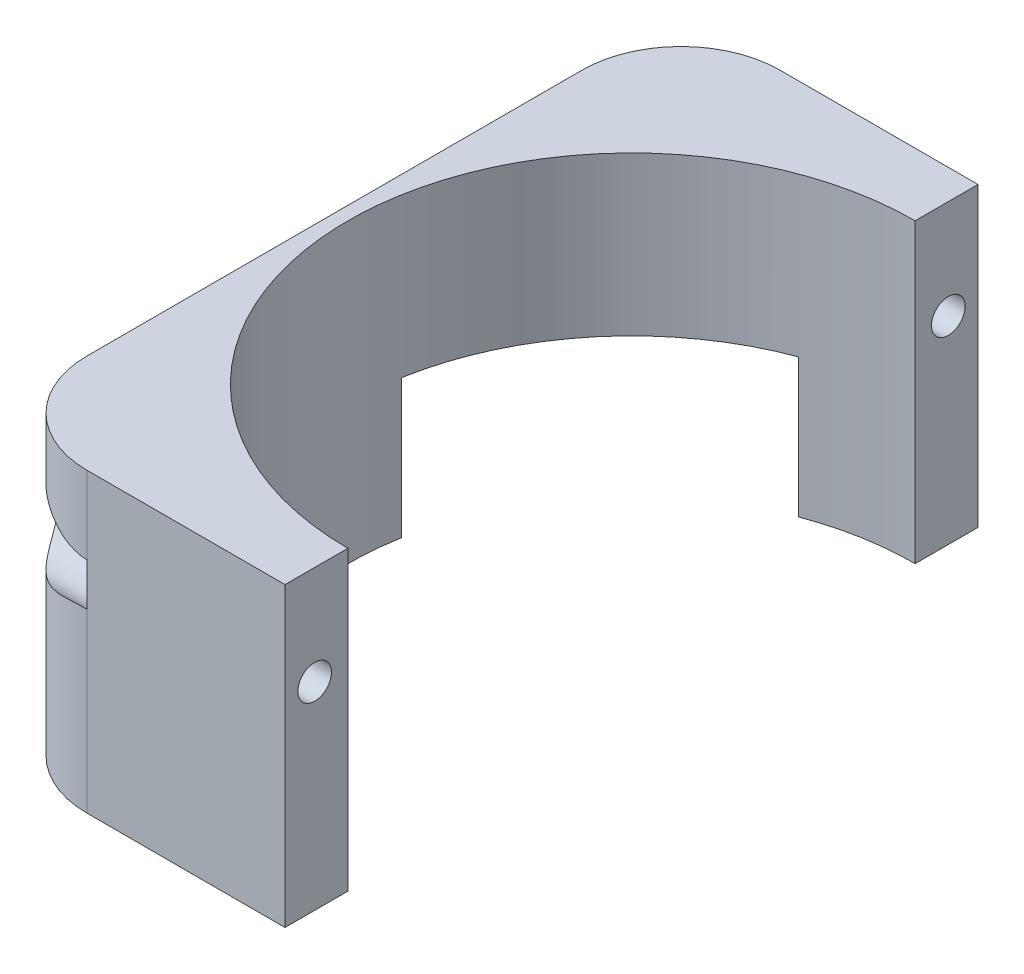
ISO-10303-21;
HEADER;
FILE_DESCRIPTION(('STEP AP214'),'2;1');
FILE_NAME('part.step','',(''),(''),'','','');
FILE_SCHEMA(('AUTOMOTIVE_DESIGN { 1 0 10303 214 1 1 1 1 }'));
ENDSEC;
DATA;
#1=APPLICATION_CONTEXT('core data for automotive mechanical design processes');
#2=APPLICATION_PROTOCOL_DEFINITION('international standard','automotive_design',2000,#1);
#3=PRODUCT_CONTEXT('',#1,'mechanical');
#4=PRODUCT('Part','Part','',(#3));
#5=PRODUCT_RELATED_PRODUCT_CATEGORY('part','',(#4));
#6=PRODUCT_DEFINITION_FORMATION('','',#4);
#7=PRODUCT_DEFINITION_CONTEXT('part definition',#1,'design');
#8=PRODUCT_DEFINITION('design','',#6,#7);
#9=PRODUCT_DEFINITION_SHAPE('','',#8);
#10=(LENGTH_UNIT() NAMED_UNIT(*) SI_UNIT(.MILLI.,.METRE.));
#11=(NAMED_UNIT(*) PLANE_ANGLE_UNIT() SI_UNIT($,.RADIAN.));
#12=(NAMED_UNIT(*) SI_UNIT($,.STERADIAN.) SOLID_ANGLE_UNIT());
#13=UNCERTAINTY_MEASURE_WITH_UNIT(LENGTH_MEASURE(1.E-05),#10,'distance_accuracy_value','');
#14=(GEOMETRIC_REPRESENTATION_CONTEXT(3) GLOBAL_UNCERTAINTY_ASSIGNED_CONTEXT((#13)) GLOBAL_UNIT_ASSIGNED_CONTEXT((#10,
#11,#12)) REPRESENTATION_CONTEXT('',''));
#15=CARTESIAN_POINT('',(0.,0.,0.));
#16=DIRECTION('',(0.,0.,1.));
#17=DIRECTION('',(1.,0.,0.));
#18=AXIS2_PLACEMENT_3D('',#15,#16,#17);
#19=CARTESIAN_POINT('',(-40.,20.,32.));
#20=DIRECTION('',(1.,0.,0.));
#21=DIRECTION('',(0.,0.,-1.));
#22=AXIS2_PLACEMENT_3D('',#19,#20,#21);
#23=CYLINDRICAL_SURFACE('',#22,1.7);
#24=CARTESIAN_POINT('',(0.,20.,32.));
#25=DIRECTION('',(1.,0.,0.));
#26=DIRECTION('',(0.,0.,-1.));
#27=AXIS2_PLACEMENT_3D('',#24,#25,#26);
#28=CIRCLE('',#27,1.7);
#29=CARTESIAN_POINT('',(0.,20.,30.3));
#30=VERTEX_POINT('',#29);
#31=EDGE_CURVE('E214',#30,#30,#28,.T.);
#32=ORIENTED_EDGE('',*,*,#31,.T.);
#33=EDGE_LOOP('',(#32));
#34=FACE_BOUND('',#33,.T.);
#35=CARTESIAN_POINT('',(-20.,20.,32.));
#36=DIRECTION('',(-1.,0.,0.));
#37=DIRECTION('',(0.,0.,1.));
#38=AXIS2_PLACEMENT_3D('',#35,#36,#37);
#39=CIRCLE('',#38,1.7);
#40=CARTESIAN_POINT('',(-20.,20.,33.7));
#41=VERTEX_POINT('',#40);
#42=EDGE_CURVE('E174',#41,#41,#39,.F.);
#43=ORIENTED_EDGE('',*,*,#42,.F.);
#44=EDGE_LOOP('',(#43));
#45=FACE_BOUND('',#44,.T.);
#46=ADVANCED_FACE('F38',(#34,#45),#23,.F.);
#47=CARTESIAN_POINT('',(-40.,20.,-32.));
#48=DIRECTION('',(1.,0.,0.));
#49=DIRECTION('',(0.,0.,-1.));
#50=AXIS2_PLACEMENT_3D('',#47,#48,#49);
#51=CYLINDRICAL_SURFACE('',#50,1.7);
#52=CARTESIAN_POINT('',(0.,20.,-32.));
#53=DIRECTION('',(1.,0.,0.));
#54=DIRECTION('',(0.,0.,-1.));
#55=AXIS2_PLACEMENT_3D('',#52,#53,#54);
#56=CIRCLE('',#55,1.7);
#57=CARTESIAN_POINT('',(0.,20.,-33.7));
#58=VERTEX_POINT('',#57);
#59=EDGE_CURVE('E224',#58,#58,#56,.T.);
#60=ORIENTED_EDGE('',*,*,#59,.T.);
#61=EDGE_LOOP('',(#60));
#62=FACE_BOUND('',#61,.T.);
#63=CARTESIAN_POINT('',(-20.,20.,-32.));
#64=DIRECTION('',(-1.,0.,0.));
#65=DIRECTION('',(0.,0.,1.));
#66=AXIS2_PLACEMENT_3D('',#63,#64,#65);
#67=CIRCLE('',#66,1.7);
#68=CARTESIAN_POINT('',(-20.,20.,-30.3));
#69=VERTEX_POINT('',#68);
#70=EDGE_CURVE('E188',#69,#69,#67,.F.);
#71=ORIENTED_EDGE('',*,*,#70,.F.);
#72=EDGE_LOOP('',(#71));
#73=FACE_BOUND('',#72,.T.);
#74=ADVANCED_FACE('F328',(#62,#73),#51,.F.);
#75=CARTESIAN_POINT('',(0.,0.,0.));
#76=DIRECTION('',(0.,1.,0.));
#77=DIRECTION('',(0.,0.,1.));
#78=AXIS2_PLACEMENT_3D('',#75,#76,#77);
#79=PLANE('',#78);
#80=DIRECTION('',(1.,0.,0.));
#81=VECTOR('',#80,1.);
#82=CARTESIAN_POINT('',(-30.,0.,35.));
#83=LINE('',#82,#81);
#84=CARTESIAN_POINT('',(-20.,0.,35.));
#85=VERTEX_POINT('',#84);
#86=CARTESIAN_POINT('',(0.,0.,35.));
#87=VERTEX_POINT('',#86);
#88=EDGE_CURVE('E259',#85,#87,#83,.T.);
#89=ORIENTED_EDGE('',*,*,#88,.F.);
#90=CARTESIAN_POINT('',(-20.,0.,25.));
#91=DIRECTION('',(0.,1.,0.));
#92=DIRECTION('',(0.,0.,1.));
#93=AXIS2_PLACEMENT_3D('',#90,#91,#92);
#94=CIRCLE('',#93,10.);
#95=CARTESIAN_POINT('',(-30.,0.,25.));
#96=VERTEX_POINT('',#95);
#97=EDGE_CURVE('E157',#85,#96,#94,.F.);
#98=ORIENTED_EDGE('',*,*,#97,.T.);
#99=DIRECTION('',(0.,0.,1.));
#100=VECTOR('',#99,1.);
#101=CARTESIAN_POINT('',(-30.,0.,-35.));
#102=LINE('',#101,#100);
#103=CARTESIAN_POINT('',(-30.,0.,-5.00000000000002));
#104=VERTEX_POINT('',#103);
#105=EDGE_CURVE('E269',#104,#96,#102,.T.);
#106=ORIENTED_EDGE('',*,*,#105,.F.);
#107=DIRECTION('',(-1.,0.,0.));
#108=VECTOR('',#107,1.);
#109=CARTESIAN_POINT('',(-30.,0.,-5.00000000000002));
#110=LINE('',#109,#108);
#111=CARTESIAN_POINT('',(-28.2103261236023,0.,-5.00000000000002));
#112=VERTEX_POINT('',#111);
#113=EDGE_CURVE('E202',#112,#104,#110,.T.);
#114=ORIENTED_EDGE('',*,*,#113,.F.);
#115=CARTESIAN_POINT('',(0.,0.,0.));
#116=DIRECTION('',(0.,1.,0.));
#117=DIRECTION('',(0.,0.,1.));
#118=AXIS2_PLACEMENT_3D('',#115,#116,#117);
#119=CIRCLE('',#118,28.65);
#120=CARTESIAN_POINT('',(0.,0.,28.65));
#121=VERTEX_POINT('',#120);
#122=EDGE_CURVE('E245',#112,#121,#119,.T.);
#123=ORIENTED_EDGE('',*,*,#122,.T.);
#124=DIRECTION('',(0.,0.,1.));
#125=VECTOR('',#124,1.);
#126=CARTESIAN_POINT('',(0.,0.,-46.2261777715974));
#127=LINE('',#126,#125);
#128=EDGE_CURVE('E229',#121,#87,#127,.T.);
#129=ORIENTED_EDGE('',*,*,#128,.T.);
#130=EDGE_LOOP('',(#89,#98,#106,#114,#123,#129));
#131=FACE_BOUND('',#130,.T.);
#132=ADVANCED_FACE('F332',(#131),#79,.F.);
#133=CARTESIAN_POINT('',(0.,30.,0.));
#134=DIRECTION('',(0.,1.,0.));
#135=DIRECTION('',(0.,0.,1.));
#136=AXIS2_PLACEMENT_3D('',#133,#134,#135);
#137=PLANE('',#136);
#138=DIRECTION('',(0.,0.,1.));
#139=VECTOR('',#138,1.);
#140=CARTESIAN_POINT('',(-30.,30.,-35.));
#141=LINE('',#140,#139);
#142=CARTESIAN_POINT('',(-30.,30.,-25.));
#143=VERTEX_POINT('',#142);
#144=CARTESIAN_POINT('',(-30.,30.,25.));
#145=VERTEX_POINT('',#144);
#146=EDGE_CURVE('E258',#143,#145,#141,.T.);
#147=ORIENTED_EDGE('',*,*,#146,.T.);
#148=CARTESIAN_POINT('',(-20.,30.,25.));
#149=DIRECTION('',(0.,1.,0.));
#150=DIRECTION('',(0.,0.,1.));
#151=AXIS2_PLACEMENT_3D('',#148,#149,#150);
#152=CIRCLE('',#151,10.);
#153=CARTESIAN_POINT('',(-20.,30.,35.));
#154=VERTEX_POINT('',#153);
#155=EDGE_CURVE('E373',#145,#154,#152,.T.);
#156=ORIENTED_EDGE('',*,*,#155,.T.);
#157=DIRECTION('',(1.,0.,0.));
#158=VECTOR('',#157,1.);
#159=CARTESIAN_POINT('',(-30.,30.,35.));
#160=LINE('',#159,#158);
#161=CARTESIAN_POINT('',(0.,30.,35.));
#162=VERTEX_POINT('',#161);
#163=EDGE_CURVE('E166',#154,#162,#160,.T.);
#164=ORIENTED_EDGE('',*,*,#163,.T.);
#165=DIRECTION('',(0.,0.,1.));
#166=VECTOR('',#165,1.);
#167=CARTESIAN_POINT('',(0.,30.,-46.2261777715974));
#168=LINE('',#167,#166);
#169=CARTESIAN_POINT('',(0.,30.,28.65));
#170=VERTEX_POINT('',#169);
#171=EDGE_CURVE('E228',#170,#162,#168,.T.);
#172=ORIENTED_EDGE('',*,*,#171,.F.);
#173=CARTESIAN_POINT('',(0.,30.,0.));
#174=DIRECTION('',(0.,1.,0.));
#175=DIRECTION('',(0.,0.,1.));
#176=AXIS2_PLACEMENT_3D('',#173,#174,#175);
#177=CIRCLE('',#176,28.65);
#178=CARTESIAN_POINT('',(0.,30.,-28.65));
#179=VERTEX_POINT('',#178);
#180=EDGE_CURVE('E246',#179,#170,#177,.T.);
#181=ORIENTED_EDGE('',*,*,#180,.F.);
#182=CARTESIAN_POINT('',(0.,30.,-35.));
#183=VERTEX_POINT('',#182);
#184=EDGE_CURVE('E234',#183,#179,#168,.T.);
#185=ORIENTED_EDGE('',*,*,#184,.F.);
#186=DIRECTION('',(-1.,0.,0.));
#187=VECTOR('',#186,1.);
#188=CARTESIAN_POINT('',(-30.,30.,-35.));
#189=LINE('',#188,#187);
#190=CARTESIAN_POINT('',(-20.,30.,-35.));
#191=VERTEX_POINT('',#190);
#192=EDGE_CURVE('E255',#183,#191,#189,.T.);
#193=ORIENTED_EDGE('',*,*,#192,.T.);
#194=CARTESIAN_POINT('',(-20.,30.,-25.));
#195=DIRECTION('',(0.,1.,0.));
#196=DIRECTION('',(0.,0.,1.));
#197=AXIS2_PLACEMENT_3D('',#194,#195,#196);
#198=CIRCLE('',#197,10.);
#199=EDGE_CURVE('E376',#191,#143,#198,.T.);
#200=ORIENTED_EDGE('',*,*,#199,.T.);
#201=EDGE_LOOP('',(#147,#156,#164,#172,#181,#185,#193,#200));
#202=FACE_BOUND('',#201,.T.);
#203=ADVANCED_FACE('F342',(#202),#137,.T.);
#204=CARTESIAN_POINT('',(0.,0.,-28.65));
#205=VERTEX_POINT('',#204);
#206=CARTESIAN_POINT('',(-9.99999999999999,0.,-26.8481377380257));
#207=VERTEX_POINT('',#206);
#208=EDGE_CURVE('E251',#205,#207,#119,.T.);
#209=ORIENTED_EDGE('',*,*,#208,.T.);
#210=DIRECTION('',(0.,0.,-1.));
#211=VECTOR('',#210,1.);
#212=CARTESIAN_POINT('',(-9.99999999999999,0.,-5.00000000000002));
#213=LINE('',#212,#211);
#214=CARTESIAN_POINT('',(-9.99999999999999,0.,-35.));
#215=VERTEX_POINT('',#214);
#216=EDGE_CURVE('E210',#207,#215,#213,.T.);
#217=ORIENTED_EDGE('',*,*,#216,.T.);
#218=DIRECTION('',(-1.,0.,0.));
#219=VECTOR('',#218,1.);
#220=CARTESIAN_POINT('',(-30.,0.,-35.));
#221=LINE('',#220,#219);
#222=CARTESIAN_POINT('',(0.,0.,-35.));
#223=VERTEX_POINT('',#222);
#224=EDGE_CURVE('E250',#223,#215,#221,.T.);
#225=ORIENTED_EDGE('',*,*,#224,.F.);
#226=EDGE_CURVE('E233',#223,#205,#127,.T.);
#227=ORIENTED_EDGE('',*,*,#226,.T.);
#228=EDGE_LOOP('',(#209,#217,#225,#227));
#229=FACE_BOUND('',#228,.T.);
#230=ADVANCED_FACE('F345',(#229),#79,.F.);
#231=CARTESIAN_POINT('',(-30.,30.,-35.));
#232=DIRECTION('',(0.,0.,1.));
#233=DIRECTION('',(1.,0.,0.));
#234=AXIS2_PLACEMENT_3D('',#231,#232,#233);
#235=PLANE('',#234);
#236=DIRECTION('',(1.,0.,0.));
#237=VECTOR('',#236,1.);
#238=CARTESIAN_POINT('',(-30.,14.,-35.));
#239=LINE('',#238,#237);
#240=CARTESIAN_POINT('',(-20.,14.,-35.));
#241=VERTEX_POINT('',#240);
#242=CARTESIAN_POINT('',(-9.99999999999999,14.,-35.));
#243=VERTEX_POINT('',#242);
#244=EDGE_CURVE('E193',#241,#243,#239,.T.);
#245=ORIENTED_EDGE('',*,*,#244,.F.);
#246=DIRECTION('',(0.,-1.,0.));
#247=VECTOR('',#246,1.);
#248=CARTESIAN_POINT('',(-20.,15.9171796086146,-35.));
#249=LINE('',#248,#247);
#250=CARTESIAN_POINT('',(-20.,17.8343592172293,-35.));
#251=VERTEX_POINT('',#250);
#252=EDGE_CURVE('E52',#241,#251,#249,.F.);
#253=ORIENTED_EDGE('',*,*,#252,.T.);
#254=DIRECTION('',(0.,-1.,0.));
#255=VECTOR('',#254,1.);
#256=CARTESIAN_POINT('',(-20.,30.,-35.));
#257=LINE('',#256,#255);
#258=CARTESIAN_POINT('',(-20.,22.1656407827707,-35.));
#259=VERTEX_POINT('',#258);
#260=EDGE_CURVE('E189',#259,#251,#257,.T.);
#261=ORIENTED_EDGE('',*,*,#260,.F.);
#262=DIRECTION('',(0.,-1.,0.));
#263=VECTOR('',#262,1.);
#264=CARTESIAN_POINT('',(-20.,30.,-35.));
#265=LINE('',#264,#263);
#266=EDGE_CURVE('E67',#259,#191,#265,.F.);
#267=ORIENTED_EDGE('',*,*,#266,.T.);
#268=ORIENTED_EDGE('',*,*,#192,.F.);
#269=DIRECTION('',(0.,-1.,0.));
#270=VECTOR('',#269,1.);
#271=CARTESIAN_POINT('',(0.,30.,-35.));
#272=LINE('',#271,#270);
#273=EDGE_CURVE('E241',#183,#223,#272,.T.);
#274=ORIENTED_EDGE('',*,*,#273,.T.);
#275=ORIENTED_EDGE('',*,*,#224,.T.);
#276=DIRECTION('',(0.,-1.,0.));
#277=VECTOR('',#276,1.);
#278=CARTESIAN_POINT('',(-9.99999999999999,0.,-35.));
#279=LINE('',#278,#277);
#280=EDGE_CURVE('E199',#243,#215,#279,.T.);
#281=ORIENTED_EDGE('',*,*,#280,.F.);
#282=EDGE_LOOP('',(#245,#253,#261,#267,#268,#274,#275,#281));
#283=FACE_BOUND('',#282,.T.);
#284=ADVANCED_FACE('F349',(#283),#235,.F.);
#285=CARTESIAN_POINT('',(-30.,30.,-35.));
#286=DIRECTION('',(1.,0.,0.));
#287=DIRECTION('',(0.,0.,-1.));
#288=AXIS2_PLACEMENT_3D('',#285,#286,#287);
#289=PLANE('',#288);
#290=ORIENTED_EDGE('',*,*,#105,.T.);
#291=DIRECTION('',(0.,-1.,0.));
#292=VECTOR('',#291,1.);
#293=CARTESIAN_POINT('',(-30.,30.,25.));
#294=LINE('',#293,#292);
#295=EDGE_CURVE('E379',#96,#145,#294,.F.);
#296=ORIENTED_EDGE('',*,*,#295,.T.);
#297=ORIENTED_EDGE('',*,*,#146,.F.);
#298=DIRECTION('',(0.,-1.,0.));
#299=VECTOR('',#298,1.);
#300=CARTESIAN_POINT('',(-30.,30.,-25.));
#301=LINE('',#300,#299);
#302=CARTESIAN_POINT('',(-30.,14.,-25.));
#303=VERTEX_POINT('',#302);
#304=EDGE_CURVE('E380',#143,#303,#301,.T.);
#305=ORIENTED_EDGE('',*,*,#304,.T.);
#306=DIRECTION('',(0.,0.,-1.));
#307=VECTOR('',#306,1.);
#308=CARTESIAN_POINT('',(-30.,14.,-5.00000000000002));
#309=LINE('',#308,#307);
#310=CARTESIAN_POINT('',(-30.,14.,-5.00000000000002));
#311=VERTEX_POINT('',#310);
#312=EDGE_CURVE('E205',#311,#303,#309,.T.);
#313=ORIENTED_EDGE('',*,*,#312,.F.);
#314=DIRECTION('',(0.,1.,0.));
#315=VECTOR('',#314,1.);
#316=CARTESIAN_POINT('',(-30.,0.,-5.00000000000002));
#317=LINE('',#316,#315);
#318=EDGE_CURVE('E194',#104,#311,#317,.T.);
#319=ORIENTED_EDGE('',*,*,#318,.F.);
#320=EDGE_LOOP('',(#290,#296,#297,#305,#313,#319));
#321=FACE_BOUND('',#320,.T.);
#322=ADVANCED_FACE('F353',(#321),#289,.F.);
#323=CARTESIAN_POINT('',(-30.,30.,35.));
#324=DIRECTION('',(0.,0.,-1.));
#325=DIRECTION('',(-1.,0.,0.));
#326=AXIS2_PLACEMENT_3D('',#323,#324,#325);
#327=PLANE('',#326);
#328=ORIENTED_EDGE('',*,*,#163,.F.);
#329=DIRECTION('',(0.,-1.,0.));
#330=VECTOR('',#329,1.);
#331=CARTESIAN_POINT('',(-20.,30.,35.));
#332=LINE('',#331,#330);
#333=CARTESIAN_POINT('',(-20.,22.1656407827708,35.));
#334=VERTEX_POINT('',#333);
#335=EDGE_CURVE('E150',#154,#334,#332,.T.);
#336=ORIENTED_EDGE('',*,*,#335,.T.);
#337=DIRECTION('',(0.,1.,0.));
#338=VECTOR('',#337,1.);
#339=CARTESIAN_POINT('',(-20.,30.,35.));
#340=LINE('',#339,#338);
#341=CARTESIAN_POINT('',(-20.,17.8343592172292,35.));
#342=VERTEX_POINT('',#341);
#343=EDGE_CURVE('E164',#342,#334,#340,.T.);
#344=ORIENTED_EDGE('',*,*,#343,.F.);
#345=DIRECTION('',(0.,-1.,0.));
#346=VECTOR('',#345,1.);
#347=CARTESIAN_POINT('',(-20.,8.9171796086146,35.));
#348=LINE('',#347,#346);
#349=EDGE_CURVE('E152',#342,#85,#348,.T.);
#350=ORIENTED_EDGE('',*,*,#349,.T.);
#351=ORIENTED_EDGE('',*,*,#88,.T.);
#352=DIRECTION('',(0.,1.,0.));
#353=VECTOR('',#352,1.);
#354=CARTESIAN_POINT('',(0.,30.,35.));
#355=LINE('',#354,#353);
#356=EDGE_CURVE('E238',#87,#162,#355,.T.);
#357=ORIENTED_EDGE('',*,*,#356,.T.);
#358=EDGE_LOOP('',(#328,#336,#344,#350,#351,#357));
#359=FACE_BOUND('',#358,.T.);
#360=ADVANCED_FACE('F163',(#359),#327,.F.);
#361=CARTESIAN_POINT('',(0.,30.,0.));
#362=DIRECTION('',(0.,-1.,0.));
#363=DIRECTION('',(0.,0.,-1.));
#364=AXIS2_PLACEMENT_3D('',#361,#362,#363);
#365=CYLINDRICAL_SURFACE('',#364,28.65);
#366=DIRECTION('',(0.,-1.,0.));
#367=VECTOR('',#366,1.);
#368=CARTESIAN_POINT('',(-9.99999999999999,30.,-26.8481377380257));
#369=LINE('',#368,#367);
#370=CARTESIAN_POINT('',(-9.99999999999999,14.,-26.8481377380257));
#371=VERTEX_POINT('',#370);
#372=EDGE_CURVE('E287',#207,#371,#369,.F.);
#373=ORIENTED_EDGE('',*,*,#372,.F.);
#374=ORIENTED_EDGE('',*,*,#208,.F.);
#375=DIRECTION('',(0.,-1.,0.));
#376=VECTOR('',#375,1.);
#377=CARTESIAN_POINT('',(0.,30.,-28.65));
#378=LINE('',#377,#376);
#379=EDGE_CURVE('E277',#179,#205,#378,.T.);
#380=ORIENTED_EDGE('',*,*,#379,.F.);
#381=ORIENTED_EDGE('',*,*,#180,.T.);
#382=DIRECTION('',(0.,-1.,0.));
#383=VECTOR('',#382,1.);
#384=CARTESIAN_POINT('',(0.,30.,28.65));
#385=LINE('',#384,#383);
#386=EDGE_CURVE('E265',#121,#170,#385,.F.);
#387=ORIENTED_EDGE('',*,*,#386,.F.);
#388=ORIENTED_EDGE('',*,*,#122,.F.);
#389=DIRECTION('',(0.,-1.,0.));
#390=VECTOR('',#389,1.);
#391=CARTESIAN_POINT('',(-28.2103261236023,30.,-5.00000000000002));
#392=LINE('',#391,#390);
#393=CARTESIAN_POINT('',(-28.2103261236023,14.,-5.00000000000002));
#394=VERTEX_POINT('',#393);
#395=EDGE_CURVE('E279',#112,#394,#392,.F.);
#396=ORIENTED_EDGE('',*,*,#395,.T.);
#397=CARTESIAN_POINT('',(0.,14.,0.));
#398=DIRECTION('',(0.,1.,0.));
#399=DIRECTION('',(-1.,0.,0.));
#400=AXIS2_PLACEMENT_3D('',#397,#398,#399);
#401=CIRCLE('',#400,28.65);
#402=EDGE_CURVE('E283',#371,#394,#401,.T.);
#403=ORIENTED_EDGE('',*,*,#402,.F.);
#404=EDGE_LOOP('',(#373,#374,#380,#381,#387,#388,#396,#403));
#405=FACE_BOUND('',#404,.T.);
#406=ADVANCED_FACE('F338',(#405),#365,.F.);
#407=CARTESIAN_POINT('',(0.,0.,-46.2261777715974));
#408=DIRECTION('',(-1.,0.,0.));
#409=DIRECTION('',(0.,0.,1.));
#410=AXIS2_PLACEMENT_3D('',#407,#408,#409);
#411=PLANE('',#410);
#412=ORIENTED_EDGE('',*,*,#31,.F.);
#413=EDGE_LOOP('',(#412));
#414=FACE_BOUND('',#413,.T.);
#415=ORIENTED_EDGE('',*,*,#128,.F.);
#416=ORIENTED_EDGE('',*,*,#386,.T.);
#417=ORIENTED_EDGE('',*,*,#171,.T.);
#418=ORIENTED_EDGE('',*,*,#356,.F.);
#419=EDGE_LOOP('',(#415,#416,#417,#418));
#420=FACE_BOUND('',#419,.T.);
#421=ADVANCED_FACE('F336',(#414,#420),#411,.F.);
#422=ORIENTED_EDGE('',*,*,#59,.F.);
#423=EDGE_LOOP('',(#422));
#424=FACE_BOUND('',#423,.T.);
#425=ORIENTED_EDGE('',*,*,#184,.T.);
#426=ORIENTED_EDGE('',*,*,#379,.T.);
#427=ORIENTED_EDGE('',*,*,#226,.F.);
#428=ORIENTED_EDGE('',*,*,#273,.F.);
#429=EDGE_LOOP('',(#425,#426,#427,#428));
#430=FACE_BOUND('',#429,.T.);
#431=ADVANCED_FACE('F322',(#424,#430),#411,.F.);
#432=CARTESIAN_POINT('',(-9.99999999999999,0.,-5.00000000000002));
#433=DIRECTION('',(1.,0.,0.));
#434=DIRECTION('',(0.,0.,-1.));
#435=AXIS2_PLACEMENT_3D('',#432,#433,#434);
#436=PLANE('',#435);
#437=ORIENTED_EDGE('',*,*,#372,.T.);
#438=DIRECTION('',(0.,0.,-1.));
#439=VECTOR('',#438,1.);
#440=CARTESIAN_POINT('',(-9.99999999999999,14.,-5.00000000000002));
#441=LINE('',#440,#439);
#442=EDGE_CURVE('E215',#371,#243,#441,.T.);
#443=ORIENTED_EDGE('',*,*,#442,.T.);
#444=ORIENTED_EDGE('',*,*,#280,.T.);
#445=ORIENTED_EDGE('',*,*,#216,.F.);
#446=EDGE_LOOP('',(#437,#443,#444,#445));
#447=FACE_BOUND('',#446,.T.);
#448=ADVANCED_FACE('F319',(#447),#436,.F.);
#449=CARTESIAN_POINT('',(-30.,14.,-5.00000000000002));
#450=DIRECTION('',(0.,1.,0.));
#451=DIRECTION('',(-1.,0.,0.));
#452=AXIS2_PLACEMENT_3D('',#449,#450,#451);
#453=PLANE('',#452);
#454=ORIENTED_EDGE('',*,*,#312,.T.);
#455=CARTESIAN_POINT('',(-20.,14.,-25.));
#456=DIRECTION('',(0.,1.,0.));
#457=DIRECTION('',(-1.,0.,0.));
#458=AXIS2_PLACEMENT_3D('',#455,#456,#457);
#459=CIRCLE('',#458,10.);
#460=EDGE_CURVE('E59',#303,#241,#459,.F.);
#461=ORIENTED_EDGE('',*,*,#460,.T.);
#462=ORIENTED_EDGE('',*,*,#244,.T.);
#463=ORIENTED_EDGE('',*,*,#442,.F.);
#464=ORIENTED_EDGE('',*,*,#402,.T.);
#465=DIRECTION('',(1.,0.,0.));
#466=VECTOR('',#465,1.);
#467=CARTESIAN_POINT('',(-30.,14.,-5.00000000000002));
#468=LINE('',#467,#466);
#469=EDGE_CURVE('E198',#311,#394,#468,.T.);
#470=ORIENTED_EDGE('',*,*,#469,.F.);
#471=EDGE_LOOP('',(#454,#461,#462,#463,#464,#470));
#472=FACE_BOUND('',#471,.T.);
#473=ADVANCED_FACE('F317',(#472),#453,.F.);
#474=CARTESIAN_POINT('',(0.,0.,-5.00000000000002));
#475=DIRECTION('',(0.,0.,-1.));
#476=DIRECTION('',(-1.,0.,0.));
#477=AXIS2_PLACEMENT_3D('',#474,#475,#476);
#478=PLANE('',#477);
#479=ORIENTED_EDGE('',*,*,#113,.T.);
#480=ORIENTED_EDGE('',*,*,#318,.T.);
#481=ORIENTED_EDGE('',*,*,#469,.T.);
#482=ORIENTED_EDGE('',*,*,#395,.F.);
#483=EDGE_LOOP('',(#479,#480,#481,#482));
#484=FACE_BOUND('',#483,.T.);
#485=ADVANCED_FACE('F313',(#484),#478,.T.);
#486=CARTESIAN_POINT('',(-20.,20.,-32.));
#487=DIRECTION('',(-1.,0.,0.));
#488=DIRECTION('',(0.,0.,1.));
#489=AXIS2_PLACEMENT_3D('',#486,#487,#488);
#490=CYLINDRICAL_SURFACE('',#489,3.7);
#491=CARTESIAN_POINT('',(-20.,20.,-32.));
#492=DIRECTION('',(-1.,0.,0.));
#493=DIRECTION('',(0.,0.,1.));
#494=AXIS2_PLACEMENT_3D('',#491,#492,#493);
#495=CIRCLE('',#494,3.7);
#496=EDGE_CURVE('E173',#251,#259,#495,.T.);
#497=ORIENTED_EDGE('',*,*,#496,.F.);
#498=CARTESIAN_POINT('',(-20.,17.8343592172293,-35.));
#499=CARTESIAN_POINT('',(-20.0786043449915,17.8343660503792,-35.0000008443972));
#500=CARTESIAN_POINT('',(-20.1571998540742,17.8330745361023,-34.9990730320988));
#501=CARTESIAN_POINT('',(-20.314254375295,17.8279556419757,-34.9953694685165));
#502=CARTESIAN_POINT('',(-20.3927134043997,17.824128603874,-34.9925939662713));
#503=CARTESIAN_POINT('',(-20.6274556165311,17.8089532329495,-34.9815229882039));
#504=CARTESIAN_POINT('',(-20.7833893754525,17.7939102127763,-34.970482965067));
#505=CARTESIAN_POINT('',(-21.0923840713117,17.7552339697213,-34.9413596134018));
#506=CARTESIAN_POINT('',(-21.2454573786877,17.7316603962643,-34.9233251318878));
#507=CARTESIAN_POINT('',(-21.5494286659798,17.677429319853,-34.8804273409507));
#508=CARTESIAN_POINT('',(-21.700325469599,17.6467681283349,-34.8555604745179));
#509=CARTESIAN_POINT('',(-22.1213309306675,17.5528904040232,-34.7763089037586));
#510=CARTESIAN_POINT('',(-22.3886451456119,17.4834691259418,-34.714360311556));
#511=CARTESIAN_POINT('',(-22.9151119901369,17.335794648728,-34.569574981159));
#512=CARTESIAN_POINT('',(-23.1742579793354,17.2575344893908,-34.4867217172713));
#513=CARTESIAN_POINT('',(-23.6857151028364,17.0991214713952,-34.299996213528));
#514=CARTESIAN_POINT('',(-23.9379897586093,17.0189616192138,-34.1960300196038));
#515=CARTESIAN_POINT('',(-24.4342622296421,16.8632815053222,-33.9672680485494));
#516=CARTESIAN_POINT('',(-24.6782651794293,16.7877583409401,-33.8424854886444));
#517=CARTESIAN_POINT('',(-25.0860947496444,16.6679610298537,-33.6121411098765));
#518=CARTESIAN_POINT('',(-25.252173670745,16.621075492956,-33.5119088567302));
#519=CARTESIAN_POINT('',(-25.5795432253813,16.5343980112878,-33.301000144431));
#520=CARTESIAN_POINT('',(-25.7408335904917,16.4946064635517,-33.1903231012368));
#521=CARTESIAN_POINT('',(-26.0575250929257,16.4243862853652,-32.9589410511579));
#522=CARTESIAN_POINT('',(-26.2129409229546,16.3939327241771,-32.8382638580197));
#523=CARTESIAN_POINT('',(-26.5174380021744,16.3446112078324,-32.5869574516238));
#524=CARTESIAN_POINT('',(-26.666521522807,16.3257390651124,-32.456331854697));
#525=CARTESIAN_POINT('',(-26.9164716756825,16.3054813517278,-32.2237696927579));
#526=CARTESIAN_POINT('',(-27.019137555774,16.3006765084915,-32.1240580449103));
#527=CARTESIAN_POINT('',(-27.2201085005376,16.2994564150384,-31.9202956873135));
#528=CARTESIAN_POINT('',(-27.3184147029133,16.3030389627598,-31.816246123504));
#529=CARTESIAN_POINT('',(-27.5100529474768,16.3196668069581,-31.6045044945664));
#530=CARTESIAN_POINT('',(-27.6033886096057,16.3327051129698,-31.4968151762811));
#531=CARTESIAN_POINT('',(-27.7845427594784,16.3693209112888,-31.27861312132));
#532=CARTESIAN_POINT('',(-27.872362378399,16.3928962346655,-31.1681009701052));
#533=CARTESIAN_POINT('',(-28.0254545588734,16.4459191605931,-30.9669780470407));
#534=CARTESIAN_POINT('',(-28.0918028217679,16.4733490885531,-30.8766521626473));
#535=CARTESIAN_POINT('',(-28.220170163923,16.5361882292329,-30.6957087597188));
#536=CARTESIAN_POINT('',(-28.2821901643393,16.5715957373126,-30.6050913075572));
#537=CARTESIAN_POINT('',(-28.4016159531312,16.6507697265581,-30.4244423831682));
#538=CARTESIAN_POINT('',(-28.459021362753,16.6945368928703,-30.3344109595969));
#539=CARTESIAN_POINT('',(-28.5689306771059,16.7906471206505,-30.1560060641417));
#540=CARTESIAN_POINT('',(-28.6214369858967,16.8429859407715,-30.0676317962612));
#541=CARTESIAN_POINT('',(-28.7217508388473,16.9567428192431,-29.8929824725232));
#542=CARTESIAN_POINT('',(-28.7695217955385,17.018223587418,-29.8067271336026));
#543=CARTESIAN_POINT('',(-28.8598007930288,17.1498407581263,-29.6382178144047));
#544=CARTESIAN_POINT('',(-28.9023112403537,17.2199731732486,-29.555962014991));
#545=CARTESIAN_POINT('',(-28.9820780113389,17.3686024992582,-29.3966142116551));
#546=CARTESIAN_POINT('',(-29.0193343634601,17.447099364832,-29.3195221797625));
#547=CARTESIAN_POINT('',(-29.0886657424486,17.6119464447145,-29.1716692658646));
#548=CARTESIAN_POINT('',(-29.1207413554058,17.6982957689554,-29.1009076681106));
#549=CARTESIAN_POINT('',(-29.1765038642805,17.8679251924597,-28.9744180774608));
#550=CARTESIAN_POINT('',(-29.2007299080995,17.950437747972,-28.917895561578));
#551=CARTESIAN_POINT('',(-29.2453914657547,18.1205512960628,-28.8113092011411));
#552=CARTESIAN_POINT('',(-29.2658257407676,18.2081539394115,-28.7612474690354));
#553=CARTESIAN_POINT('',(-29.3030478029654,18.3877225726149,-28.6682165343994));
#554=CARTESIAN_POINT('',(-29.3198376462888,18.4796860662631,-28.6252433359184));
#555=CARTESIAN_POINT('',(-29.3499617542955,18.6673551066234,-28.5468268216461));
#556=CARTESIAN_POINT('',(-29.3632947526592,18.7630620098965,-28.5113862660848));
#557=CARTESIAN_POINT('',(-29.3861580535643,18.953294731433,-28.4497933129243));
#558=CARTESIAN_POINT('',(-29.3958264895233,19.0476963014228,-28.4233087690305));
#559=CARTESIAN_POINT('',(-29.4122567001751,19.238551833906,-28.3778680938525));
#560=CARTESIAN_POINT('',(-29.4190174381122,19.3350065156042,-28.3589146480056));
#561=CARTESIAN_POINT('',(-29.4350729704324,19.6263368374306,-28.3136896515264));
#562=CARTESIAN_POINT('',(-29.4401660575222,19.823393326153,-28.2989839149003));
#563=CARTESIAN_POINT('',(-29.4394147499814,20.2166293533742,-28.3011243191471));
#564=CARTESIAN_POINT('',(-29.4336022766278,20.4128097716997,-28.3178783752981));
#565=CARTESIAN_POINT('',(-29.4107714684405,20.7994362532716,-28.3820901469573));
#566=CARTESIAN_POINT('',(-29.3937533185593,20.9898824111091,-28.4295473557018));
#567=CARTESIAN_POINT('',(-29.3476278182732,21.3595956144478,-28.553334075577));
#568=CARTESIAN_POINT('',(-29.3185203464792,21.5388625476774,-28.6296638766168));
#569=CARTESIAN_POINT('',(-29.2470425196215,21.8811746936071,-28.808069345007));
#570=CARTESIAN_POINT('',(-29.2046737650043,22.0442218606726,-28.9101419052872));
#571=CARTESIAN_POINT('',(-29.1054694163612,22.3501249748845,-29.1358916839789));
#572=CARTESIAN_POINT('',(-29.0486067261279,22.4929423160326,-29.2596092300165));
#573=CARTESIAN_POINT('',(-28.9198021931057,22.7549196229738,-29.5231170499394));
#574=CARTESIAN_POINT('',(-28.8478599451688,22.8740789529712,-29.6629077556223));
#575=CARTESIAN_POINT('',(-28.6865108754612,23.0905081071158,-29.9571683463305));
#576=CARTESIAN_POINT('',(-28.5966324606494,23.1869863572045,-30.1119586359652));
#577=CARTESIAN_POINT('',(-28.4017784744718,23.3533547018341,-30.4262587494099));
#578=CARTESIAN_POINT('',(-28.2967962522616,23.4232330336251,-30.5857706276282));
#579=CARTESIAN_POINT('',(-28.1095067612811,23.5194738812932,-30.8526330263834));
#580=CARTESIAN_POINT('',(-28.0308295997407,23.5526016177842,-30.9601883423113));
#581=CARTESIAN_POINT('',(-27.8678079258581,23.6082605462419,-31.1737856488222));
#582=CARTESIAN_POINT('',(-27.7834618245996,23.6307887530497,-31.2798272049396));
#583=CARTESIAN_POINT('',(-27.609591120968,23.6661470000728,-31.4894296672647));
#584=CARTESIAN_POINT('',(-27.5200604223691,23.6789653632219,-31.5929874420785));
#585=CARTESIAN_POINT('',(-27.3364340458051,23.6958266323128,-31.7967314543122));
#586=CARTESIAN_POINT('',(-27.2423370738936,23.69986703582,-31.896916722281));
#587=CARTESIAN_POINT('',(-27.0116247146608,23.7001784314014,-32.1326084970653));
#588=CARTESIAN_POINT('',(-26.8730561407155,23.6926956430536,-32.2662156847008));
#589=CARTESIAN_POINT('',(-26.5891560194017,23.6649247382607,-32.5246207957746));
#590=CARTESIAN_POINT('',(-26.4438217500108,23.6446314258251,-32.6494151218402));
#591=CARTESIAN_POINT('',(-26.1470460322574,23.5934992273278,-32.8898914486316));
#592=CARTESIAN_POINT('',(-25.9955911256673,23.5626358465536,-33.0055515088869));
#593=CARTESIAN_POINT('',(-25.6876772695822,23.492500988521,-33.2271697541635));
#594=CARTESIAN_POINT('',(-25.5312184507375,23.4532297306371,-33.3331281922119));
#595=CARTESIAN_POINT('',(-25.1342959027998,23.3469112863444,-33.5859644350367));
#596=CARTESIAN_POINT('',(-24.891020885501,23.2758060974367,-33.7267437147348));
#597=CARTESIAN_POINT('',(-24.3955526354281,23.125108362918,-33.9865155092904));
#598=CARTESIAN_POINT('',(-24.1433539844704,23.045510599629,-34.1054945070801));
#599=CARTESIAN_POINT('',(-23.6313083011583,22.8842111223681,-34.3215135748361));
#600=CARTESIAN_POINT('',(-23.371484652359,22.8025159209295,-34.4186141195212));
#601=CARTESIAN_POINT('',(-22.8434180762443,22.6436982029265,-34.5912513216062));
#602=CARTESIAN_POINT('',(-22.5751780700958,22.5665741260785,-34.6667953709631));
#603=CARTESIAN_POINT('',(-22.1182176235739,22.4482713460677,-34.7749190947279));
#604=CARTESIAN_POINT('',(-21.9318323439235,22.4035337158658,-34.8134926545698));
#605=CARTESIAN_POINT('',(-21.5553359996508,22.3232416694088,-34.8801524380775));
#606=CARTESIAN_POINT('',(-21.3652285857983,22.2876786965391,-34.9082484444628));
#607=CARTESIAN_POINT('',(-21.0770785608809,22.2434820261691,-34.9423009044151));
#608=CARTESIAN_POINT('',(-20.9802013219753,22.2302456700619,-34.952322936746));
#609=CARTESIAN_POINT('',(-20.7857849722095,22.207246903686,-34.9695568041124));
#610=CARTESIAN_POINT('',(-20.6882459086387,22.1974842478193,-34.976768837824));
#611=CARTESIAN_POINT('',(-20.4923966239427,22.1817078588322,-34.9883528314022));
#612=CARTESIAN_POINT('',(-20.3940849629475,22.1757055484312,-34.9927161394322));
#613=CARTESIAN_POINT('',(-20.1971846828692,22.1676602463749,-34.9985419555121));
#614=CARTESIAN_POINT('',(-20.0985959876025,22.1656184785464,-35.0000035669268));
#615=CARTESIAN_POINT('',(-20.,22.1656407827707,-35.));
#616=B_SPLINE_CURVE_WITH_KNOTS('',3,(#498,#499,#500,#501,#502,#503,#504,#505,#506,#507,#508,
#509,#510,#511,#512,#513,#514,#515,#516,#517,#518,#519,#520,#521,#522,#523,#524,#525,#526,#527,
#528,#529,#530,#531,#532,#533,#534,#535,#536,#537,#538,#539,#540,#541,#542,#543,#544,#545,#546,
#547,#548,#549,#550,#551,#552,#553,#554,#555,#556,#557,#558,#559,#560,#561,#562,#563,#564,#565,
#566,#567,#568,#569,#570,#571,#572,#573,#574,#575,#576,#577,#578,#579,#580,#581,#582,#583,#584,
#585,#586,#587,#588,#589,#590,#591,#592,#593,#594,#595,#596,#597,#598,#599,#600,#601,#602,#603,
#604,#605,#606,#607,#608,#609,#610,#611,#612,#613,#614,#615),.UNSPECIFIED.,.F.,.F.,(4,2,2,2,2,2,
2,2,2,2,2,2,2,2,2,2,2,2,2,2,2,2,2,2,2,2,2,2,2,2,2,2,2,2,2,2,2,2,2,2,2,2,2,2,2,2,2,2,2,2,2,2,2,2,
2,2,2,2,4),(0.,0.235780126523687,0.471528480131235,0.942171300051263,1.409584829904,
1.87724216263448,2.72501431854695,3.57345877204935,4.42576502935175,5.27753216547793,
5.87584131666611,6.47418394335089,7.07091490765718,7.66742998102452,8.09669569565732,
8.52584872166699,8.9546848058669,9.38343265944062,9.7292556796389,10.0750048747306,
10.4207824191259,10.7663893831318,11.1144868989403,11.4624245771738,11.8103603705879,
12.1582567748828,12.4665927943027,12.7750293746732,13.0832914844241,13.3916663584376,
13.6868657265885,13.9821702626086,14.5721071715853,15.1603199906631,15.7485231013811,
16.3367321183944,16.9248701743747,17.5141159152775,18.1033774896856,18.7108757198241,
19.3186422805345,19.7300810328275,20.1416355898708,20.5536843004274,20.9658504630754,
21.5428662800823,22.1201162870972,22.6987131478158,23.2772949138964,24.1457767679501,
25.0147953074146,25.8813814726105,26.7476701178879,27.3338266383131,27.919434495579,
28.2142169783377,28.5089786152094,28.804631355955,29.1003754402908),.UNSPECIFIED.);
#617=EDGE_CURVE('E11',#251,#259,#616,.T.);
#618=ORIENTED_EDGE('',*,*,#617,.T.);
#619=EDGE_LOOP('',(#497,#618));
#620=FACE_BOUND('',#619,.T.);
#621=ADVANCED_FACE('F308',(#620),#490,.F.);
#622=CARTESIAN_POINT('',(-20.,20.,-32.));
#623=DIRECTION('',(-1.,0.,0.));
#624=DIRECTION('',(0.,0.,1.));
#625=AXIS2_PLACEMENT_3D('',#622,#623,#624);
#626=PLANE('',#625);
#627=ORIENTED_EDGE('',*,*,#70,.T.);
#628=EDGE_LOOP('',(#627));
#629=FACE_BOUND('',#628,.T.);
#630=ORIENTED_EDGE('',*,*,#260,.T.);
#631=ORIENTED_EDGE('',*,*,#496,.T.);
#632=EDGE_LOOP('',(#630,#631));
#633=FACE_BOUND('',#632,.T.);
#634=ADVANCED_FACE('F306',(#629,#633),#626,.T.);
#635=CARTESIAN_POINT('',(-20.,20.,32.));
#636=DIRECTION('',(-1.,0.,0.));
#637=DIRECTION('',(0.,0.,1.));
#638=AXIS2_PLACEMENT_3D('',#635,#636,#637);
#639=CYLINDRICAL_SURFACE('',#638,3.7);
#640=CARTESIAN_POINT('',(-20.,20.,32.));
#641=DIRECTION('',(-1.,0.,0.));
#642=DIRECTION('',(0.,0.,1.));
#643=AXIS2_PLACEMENT_3D('',#640,#641,#642);
#644=CIRCLE('',#643,3.7);
#645=EDGE_CURVE('E171',#334,#342,#644,.T.);
#646=ORIENTED_EDGE('',*,*,#645,.F.);
#647=CARTESIAN_POINT('',(-20.,22.1656407827708,35.));
#648=CARTESIAN_POINT('',(-20.0786043449915,22.1656339496208,35.0000008443972));
#649=CARTESIAN_POINT('',(-20.1571998540742,22.1669254638978,34.9990730320988));
#650=CARTESIAN_POINT('',(-20.314254375295,22.1720443580244,34.9953694685165));
#651=CARTESIAN_POINT('',(-20.3927134043997,22.1758713961261,34.9925939662713));
#652=CARTESIAN_POINT('',(-20.6274556165311,22.1910467670506,34.9815229882038));
#653=CARTESIAN_POINT('',(-20.7833893754525,22.2060897872238,34.970482965067));
#654=CARTESIAN_POINT('',(-21.0923840713117,22.2447660302787,34.9413596134018));
#655=CARTESIAN_POINT('',(-21.2454573786877,22.2683396037357,34.9233251318877));
#656=CARTESIAN_POINT('',(-21.5494286659798,22.322570680147,34.8804273409506));
#657=CARTESIAN_POINT('',(-21.700325469599,22.3532318716651,34.8555604745178));
#658=CARTESIAN_POINT('',(-22.1213309306675,22.4471095959769,34.7763089037586));
#659=CARTESIAN_POINT('',(-22.388645145612,22.5165308740582,34.7143603115559));
#660=CARTESIAN_POINT('',(-22.9151119901369,22.664205351272,34.569574981159));
#661=CARTESIAN_POINT('',(-23.1742579793354,22.7424655106092,34.4867217172713));
#662=CARTESIAN_POINT('',(-23.6857151028364,22.9008785286048,34.299996213528));
#663=CARTESIAN_POINT('',(-23.9379897586093,22.9810383807863,34.1960300196038));
#664=CARTESIAN_POINT('',(-24.4342622296421,23.1367184946778,33.9672680485494));
#665=CARTESIAN_POINT('',(-24.6782651794293,23.2122416590599,33.8424854886443));
#666=CARTESIAN_POINT('',(-25.0860947496444,23.3320389701463,33.6121411098764));
#667=CARTESIAN_POINT('',(-25.252173670745,23.378924507044,33.5119088567302));
#668=CARTESIAN_POINT('',(-25.5795432253813,23.4656019887122,33.301000144431));
#669=CARTESIAN_POINT('',(-25.7408335904917,23.5053935364483,33.1903231012368));
#670=CARTESIAN_POINT('',(-26.0575250929257,23.5756137146348,32.9589410511579));
#671=CARTESIAN_POINT('',(-26.2129409229546,23.6060672758229,32.8382638580197));
#672=CARTESIAN_POINT('',(-26.5174380021744,23.6553887921676,32.5869574516237));
#673=CARTESIAN_POINT('',(-26.666521522807,23.6742609348876,32.456331854697));
#674=CARTESIAN_POINT('',(-26.9164716756825,23.6945186482722,32.2237696927579));
#675=CARTESIAN_POINT('',(-27.019137555774,23.6993234915085,32.1240580449103));
#676=CARTESIAN_POINT('',(-27.2201085005375,23.7005435849616,31.9202956873135));
#677=CARTESIAN_POINT('',(-27.3184147029133,23.6969610372402,31.8162461235039));
#678=CARTESIAN_POINT('',(-27.5100529474767,23.6803331930419,31.6045044945663));
#679=CARTESIAN_POINT('',(-27.6033886096057,23.6672948870302,31.4968151762811));
#680=CARTESIAN_POINT('',(-27.7845427594784,23.6306790887112,31.27861312132));
#681=CARTESIAN_POINT('',(-27.872362378399,23.6071037653345,31.1681009701052));
#682=CARTESIAN_POINT('',(-28.0254545588734,23.5540808394069,30.9669780470407));
#683=CARTESIAN_POINT('',(-28.0918028217679,23.5266509114469,30.8766521626473));
#684=CARTESIAN_POINT('',(-28.220170163923,23.463811770767,30.6957087597188));
#685=CARTESIAN_POINT('',(-28.2821901643393,23.4284042626874,30.6050913075571));
#686=CARTESIAN_POINT('',(-28.4016159531312,23.3492302734418,30.4244423831682));
#687=CARTESIAN_POINT('',(-28.459021362753,23.3054631071297,30.3344109595969));
#688=CARTESIAN_POINT('',(-28.5689306771059,23.2093528793494,30.1560060641417));
#689=CARTESIAN_POINT('',(-28.6214369858967,23.1570140592285,30.0676317962612));
#690=CARTESIAN_POINT('',(-28.7217508388473,23.0432571807569,29.8929824725232));
#691=CARTESIAN_POINT('',(-28.7695217955385,22.981776412582,29.8067271336026));
#692=CARTESIAN_POINT('',(-28.8598007930288,22.8501592418737,29.6382178144047));
#693=CARTESIAN_POINT('',(-28.9023112403536,22.7800268267513,29.555962014991));
#694=CARTESIAN_POINT('',(-28.9820780113389,22.6313975007417,29.3966142116551));
#695=CARTESIAN_POINT('',(-29.0193343634601,22.552900635168,29.3195221797624));
#696=CARTESIAN_POINT('',(-29.0886657424486,22.3880535552854,29.1716692658646));
#697=CARTESIAN_POINT('',(-29.1207413554058,22.3017042310446,29.1009076681106));
#698=CARTESIAN_POINT('',(-29.1765038642805,22.1320748075402,28.9744180774608));
#699=CARTESIAN_POINT('',(-29.2007299080995,22.049562252028,28.917895561578));
#700=CARTESIAN_POINT('',(-29.2453914657547,21.8794487039372,28.8113092011411));
#701=CARTESIAN_POINT('',(-29.2658257407675,21.7918460605885,28.7612474690354));
#702=CARTESIAN_POINT('',(-29.3030478029654,21.6122774273851,28.6682165343994));
#703=CARTESIAN_POINT('',(-29.3198376462888,21.5203139337369,28.6252433359184));
#704=CARTESIAN_POINT('',(-29.3499617542955,21.3326448933766,28.5468268216461));
#705=CARTESIAN_POINT('',(-29.3632947526592,21.2369379901035,28.5113862660848));
#706=CARTESIAN_POINT('',(-29.3861580535643,21.046705268567,28.4497933129243));
#707=CARTESIAN_POINT('',(-29.3958264895233,20.9523036985772,28.4233087690305));
#708=CARTESIAN_POINT('',(-29.4122567001751,20.761448166094,28.3778680938525));
#709=CARTESIAN_POINT('',(-29.4190174381122,20.6649934843958,28.3589146480056));
#710=CARTESIAN_POINT('',(-29.4350729704324,20.3736631625693,28.3136896515265));
#711=CARTESIAN_POINT('',(-29.4401660575222,20.176606673847,28.2989839149003));
#712=CARTESIAN_POINT('',(-29.4394147499813,19.7833706466257,28.3011243191471));
#713=CARTESIAN_POINT('',(-29.4336022766278,19.5871902283003,28.3178783752981));
#714=CARTESIAN_POINT('',(-29.4107714684405,19.2005637467284,28.3820901469573));
#715=CARTESIAN_POINT('',(-29.3937533185593,19.0101175888909,28.4295473557019));
#716=CARTESIAN_POINT('',(-29.3476278182732,18.6404043855522,28.553334075577));
#717=CARTESIAN_POINT('',(-29.3185203464792,18.4611374523225,28.6296638766169));
#718=CARTESIAN_POINT('',(-29.2470425196215,18.1188253063928,28.8080693450071));
#719=CARTESIAN_POINT('',(-29.2046737650043,17.9557781393273,28.9101419052872));
#720=CARTESIAN_POINT('',(-29.1054694163612,17.6498750251155,29.1358916839789));
#721=CARTESIAN_POINT('',(-29.0486067261279,17.5070576839673,29.2596092300165));
#722=CARTESIAN_POINT('',(-28.9198021931056,17.2450803770261,29.5231170499394));
#723=CARTESIAN_POINT('',(-28.8478599451688,17.1259210470288,29.6629077556224));
#724=CARTESIAN_POINT('',(-28.6865108754611,16.9094918928842,29.9571683463305));
#725=CARTESIAN_POINT('',(-28.5966324606494,16.8130136427955,30.1119586359652));
#726=CARTESIAN_POINT('',(-28.4017784744718,16.6466452981659,30.4262587494099));
#727=CARTESIAN_POINT('',(-28.2967962522615,16.5767669663749,30.5857706276283));
#728=CARTESIAN_POINT('',(-28.1095067612811,16.4805261187068,30.8526330263834));
#729=CARTESIAN_POINT('',(-28.0308295997407,16.4473983822158,30.9601883423113));
#730=CARTESIAN_POINT('',(-27.867807925858,16.3917394537581,31.1737856488222));
#731=CARTESIAN_POINT('',(-27.7834618245996,16.3692112469503,31.2798272049396));
#732=CARTESIAN_POINT('',(-27.6095911209679,16.3338529999272,31.4894296672648));
#733=CARTESIAN_POINT('',(-27.520060422369,16.3210346367781,31.5929874420785));
#734=CARTESIAN_POINT('',(-27.3364340458051,16.3041733676872,31.7967314543122));
#735=CARTESIAN_POINT('',(-27.2423370738935,16.30013296418,31.896916722281));
#736=CARTESIAN_POINT('',(-27.0116247146607,16.2998215685986,32.1326084970653));
#737=CARTESIAN_POINT('',(-26.8730561407155,16.3073043569464,32.2662156847009));
#738=CARTESIAN_POINT('',(-26.5891560194017,16.3350752617393,32.5246207957747));
#739=CARTESIAN_POINT('',(-26.4438217500108,16.3553685741749,32.6494151218402));
#740=CARTESIAN_POINT('',(-26.1470460322573,16.4065007726722,32.8898914486316));
#741=CARTESIAN_POINT('',(-25.9955911256672,16.4373641534464,33.0055515088869));
#742=CARTESIAN_POINT('',(-25.6876772695821,16.507499011479,33.2271697541635));
#743=CARTESIAN_POINT('',(-25.5312184507374,16.5467702693629,33.333128192212));
#744=CARTESIAN_POINT('',(-25.1342959027997,16.6530887136556,33.5859644350367));
#745=CARTESIAN_POINT('',(-24.8910208855009,16.7241939025633,33.7267437147348));
#746=CARTESIAN_POINT('',(-24.395552635428,16.8748916370821,33.9865155092905));
#747=CARTESIAN_POINT('',(-24.1433539844703,16.954489400371,34.1054945070801));
#748=CARTESIAN_POINT('',(-23.6313083011582,17.1157888776319,34.3215135748361));
#749=CARTESIAN_POINT('',(-23.3714846523589,17.1974840790705,34.4186141195212));
#750=CARTESIAN_POINT('',(-22.8434180762441,17.3563017970735,34.5912513216062));
#751=CARTESIAN_POINT('',(-22.5751780700957,17.4334258739215,34.6667953709631));
#752=CARTESIAN_POINT('',(-22.1182176235737,17.5517286539323,34.7749190947279));
#753=CARTESIAN_POINT('',(-21.9318323439233,17.5964662841341,34.8134926545698));
#754=CARTESIAN_POINT('',(-21.5553359996507,17.6767583305912,34.8801524380775));
#755=CARTESIAN_POINT('',(-21.3652285857982,17.7123213034609,34.9082484444628));
#756=CARTESIAN_POINT('',(-21.0770785608808,17.7565179738309,34.9423009044151));
#757=CARTESIAN_POINT('',(-20.9802013219753,17.769754329938,34.952322936746));
#758=CARTESIAN_POINT('',(-20.7857849722094,17.7927530963139,34.9695568041123));
#759=CARTESIAN_POINT('',(-20.6882459086387,17.8025157521807,34.976768837824));
#760=CARTESIAN_POINT('',(-20.4923966239427,17.8182921411677,34.9883528314022));
#761=CARTESIAN_POINT('',(-20.3940849629475,17.8242944515687,34.9927161394322));
#762=CARTESIAN_POINT('',(-20.1971846828691,17.8323397536251,34.998541955512));
#763=CARTESIAN_POINT('',(-20.0985959876025,17.8343815214536,35.0000035669268));
#764=CARTESIAN_POINT('',(-20.,17.8343592172292,35.));
#765=B_SPLINE_CURVE_WITH_KNOTS('',3,(#647,#648,#649,#650,#651,#652,#653,#654,#655,#656,#657,
#658,#659,#660,#661,#662,#663,#664,#665,#666,#667,#668,#669,#670,#671,#672,#673,#674,#675,#676,
#677,#678,#679,#680,#681,#682,#683,#684,#685,#686,#687,#688,#689,#690,#691,#692,#693,#694,#695,
#696,#697,#698,#699,#700,#701,#702,#703,#704,#705,#706,#707,#708,#709,#710,#711,#712,#713,#714,
#715,#716,#717,#718,#719,#720,#721,#722,#723,#724,#725,#726,#727,#728,#729,#730,#731,#732,#733,
#734,#735,#736,#737,#738,#739,#740,#741,#742,#743,#744,#745,#746,#747,#748,#749,#750,#751,#752,
#753,#754,#755,#756,#757,#758,#759,#760,#761,#762,#763,#764),.UNSPECIFIED.,.F.,.F.,(4,2,2,2,2,2,
2,2,2,2,2,2,2,2,2,2,2,2,2,2,2,2,2,2,2,2,2,2,2,2,2,2,2,2,2,2,2,2,2,2,2,2,2,2,2,2,2,2,2,2,2,2,2,2,
2,2,2,2,4),(0.,0.235780126523687,0.471528480131235,0.942171300051263,1.409584829904,
1.87724216263448,2.72501431854695,3.57345877204936,4.42576502935176,5.27753216547794,
5.87584131666612,6.4741839433509,7.07091490765718,7.66742998102451,8.0966956956573,
8.52584872166697,8.95468480586688,9.3834326594406,9.72925567963888,10.0750048747305,
10.4207824191259,10.7663893831317,11.1144868989403,11.4624245771738,11.8103603705879,
12.1582567748828,12.4665927943027,12.7750293746732,13.0832914844241,13.3916663584376,
13.6868657265885,13.9821702626086,14.5721071715853,15.1603199906631,15.7485231013811,
16.3367321183944,16.9248701743746,17.5141159152774,18.1033774896855,18.710875719824,
19.3186422805345,19.7300810328275,20.1416355898707,20.5536843004274,20.9658504630754,
21.5428662800823,22.1201162870972,22.6987131478158,23.2772949138964,24.1457767679501,
25.0147953074147,25.8813814726106,26.7476701178879,27.3338266383131,27.9194344955789,
28.2142169783376,28.5089786152093,28.8046313559549,29.1003754402907),.UNSPECIFIED.);
#766=EDGE_CURVE('E146',#334,#342,#765,.T.);
#767=ORIENTED_EDGE('',*,*,#766,.T.);
#768=EDGE_LOOP('',(#646,#767));
#769=FACE_BOUND('',#768,.T.);
#770=ADVANCED_FACE('F176',(#769),#639,.F.);
#771=CARTESIAN_POINT('',(-20.,20.,32.));
#772=DIRECTION('',(-1.,0.,0.));
#773=DIRECTION('',(0.,0.,1.));
#774=AXIS2_PLACEMENT_3D('',#771,#772,#773);
#775=PLANE('',#774);
#776=ORIENTED_EDGE('',*,*,#42,.T.);
#777=EDGE_LOOP('',(#776));
#778=FACE_BOUND('',#777,.T.);
#779=ORIENTED_EDGE('',*,*,#343,.T.);
#780=ORIENTED_EDGE('',*,*,#645,.T.);
#781=EDGE_LOOP('',(#779,#780));
#782=FACE_BOUND('',#781,.T.);
#783=ADVANCED_FACE('F170',(#778,#782),#775,.T.);
#784=CARTESIAN_POINT('',(-20.,30.,25.));
#785=DIRECTION('',(0.,-1.,0.));
#786=DIRECTION('',(0.,0.,-1.));
#787=AXIS2_PLACEMENT_3D('',#784,#785,#786);
#788=CYLINDRICAL_SURFACE('',#787,10.);
#789=ORIENTED_EDGE('',*,*,#155,.F.);
#790=ORIENTED_EDGE('',*,*,#295,.F.);
#791=ORIENTED_EDGE('',*,*,#97,.F.);
#792=ORIENTED_EDGE('',*,*,#349,.F.);
#793=ORIENTED_EDGE('',*,*,#766,.F.);
#794=ORIENTED_EDGE('',*,*,#335,.F.);
#795=EDGE_LOOP('',(#789,#790,#791,#792,#793,#794));
#796=FACE_BOUND('',#795,.T.);
#797=ADVANCED_FACE('F149',(#796),#788,.T.);
#798=CARTESIAN_POINT('',(-20.,30.,-25.));
#799=DIRECTION('',(0.,-1.,0.));
#800=DIRECTION('',(0.,0.,-1.));
#801=AXIS2_PLACEMENT_3D('',#798,#799,#800);
#802=CYLINDRICAL_SURFACE('',#801,10.);
#803=ORIENTED_EDGE('',*,*,#199,.F.);
#804=ORIENTED_EDGE('',*,*,#266,.F.);
#805=ORIENTED_EDGE('',*,*,#617,.F.);
#806=ORIENTED_EDGE('',*,*,#252,.F.);
#807=ORIENTED_EDGE('',*,*,#460,.F.);
#808=ORIENTED_EDGE('',*,*,#304,.F.);
#809=EDGE_LOOP('',(#803,#804,#805,#806,#807,#808));
#810=FACE_BOUND('',#809,.T.);
#811=ADVANCED_FACE('F40',(#810),#802,.T.);
#812=CLOSED_SHELL('',(#46,#74,#132,#203,#230,#284,#322,#360,#406,#421,#431,#448,#473,#485,#621,
#634,#770,#783,#797,#811));
#813=MANIFOLD_SOLID_BREP('B2',#812);
#814=ADVANCED_BREP_SHAPE_REPRESENTATION('',(#18,#813),#14);
#815=SHAPE_DEFINITION_REPRESENTATION(#9,#814);
ENDSEC;
END-ISO-10303-21;
